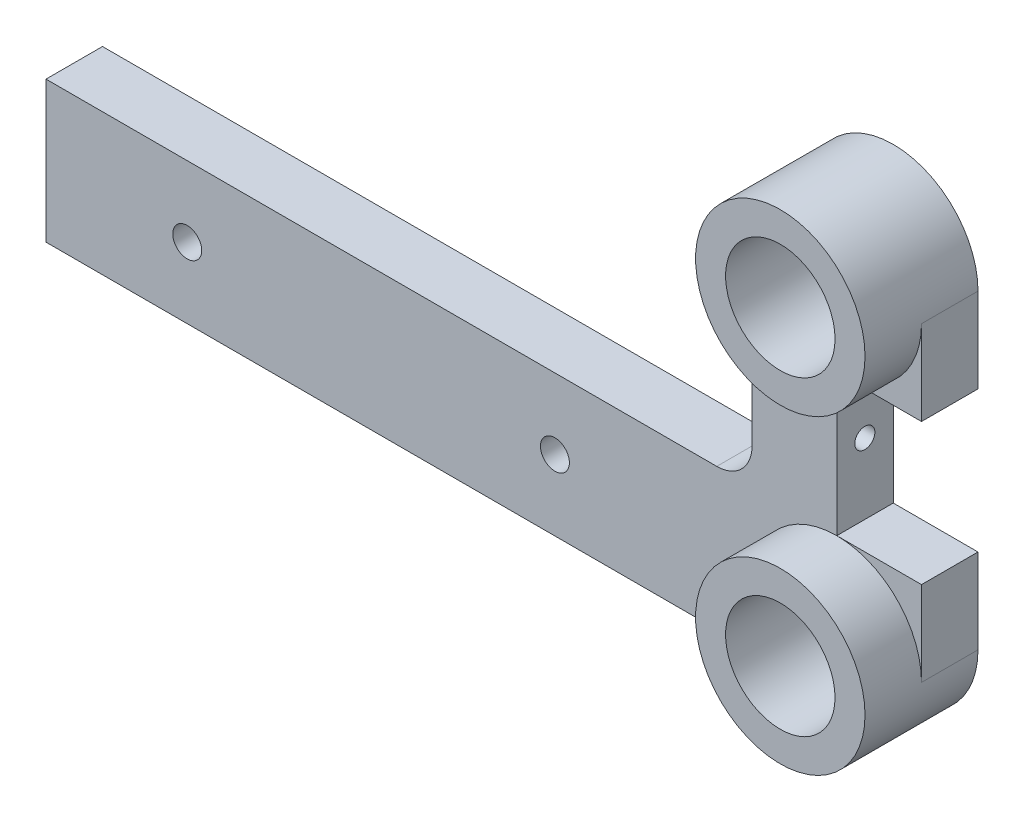
ISO-10303-21;
HEADER;
FILE_DESCRIPTION(('STEP AP214'),'2;1');
FILE_NAME('part.step','',(''),(''),'','','');
FILE_SCHEMA(('AUTOMOTIVE_DESIGN { 1 0 10303 214 1 1 1 1 }'));
ENDSEC;
DATA;
#1=APPLICATION_CONTEXT('core data for automotive mechanical design processes');
#2=APPLICATION_PROTOCOL_DEFINITION('international standard','automotive_design',2000,#1);
#3=PRODUCT_CONTEXT('',#1,'mechanical');
#4=PRODUCT('Part','Part','',(#3));
#5=PRODUCT_RELATED_PRODUCT_CATEGORY('part','',(#4));
#6=PRODUCT_DEFINITION_FORMATION('','',#4);
#7=PRODUCT_DEFINITION_CONTEXT('part definition',#1,'design');
#8=PRODUCT_DEFINITION('design','',#6,#7);
#9=PRODUCT_DEFINITION_SHAPE('','',#8);
#10=(LENGTH_UNIT() NAMED_UNIT(*) SI_UNIT(.MILLI.,.METRE.));
#11=(NAMED_UNIT(*) PLANE_ANGLE_UNIT() SI_UNIT($,.RADIAN.));
#12=(NAMED_UNIT(*) SI_UNIT($,.STERADIAN.) SOLID_ANGLE_UNIT());
#13=UNCERTAINTY_MEASURE_WITH_UNIT(LENGTH_MEASURE(1.E-05),#10,'distance_accuracy_value','');
#14=(GEOMETRIC_REPRESENTATION_CONTEXT(3) GLOBAL_UNCERTAINTY_ASSIGNED_CONTEXT((#13)) GLOBAL_UNIT_ASSIGNED_CONTEXT((#10,
#11,#12)) REPRESENTATION_CONTEXT('',''));
#15=CARTESIAN_POINT('',(0.,0.,0.));
#16=DIRECTION('',(0.,0.,1.));
#17=DIRECTION('',(1.,0.,0.));
#18=AXIS2_PLACEMENT_3D('',#15,#16,#17);
#19=CARTESIAN_POINT('',(0.,44.0000001788139,8.));
#20=DIRECTION('',(0.,0.,1.));
#21=DIRECTION('',(1.,0.,0.));
#22=AXIS2_PLACEMENT_3D('',#19,#20,#21);
#23=PLANE('',#22);
#24=CARTESIAN_POINT('',(-39.9238068438474,1.99999999999999,8.));
#25=DIRECTION('',(0.,0.,1.));
#26=DIRECTION('',(1.,0.,0.));
#27=AXIS2_PLACEMENT_3D('',#24,#25,#26);
#28=CIRCLE('',#27,2.04999999999998);
#29=CARTESIAN_POINT('',(-37.8738068438474,1.99999999999999,8.));
#30=VERTEX_POINT('',#29);
#31=EDGE_CURVE('E553',#30,#30,#28,.T.);
#32=ORIENTED_EDGE('',*,*,#31,.F.);
#33=EDGE_LOOP('',(#32));
#34=FACE_BOUND('',#33,.T.);
#35=CARTESIAN_POINT('',(-92.,1.99999999999999,8.));
#36=DIRECTION('',(0.,0.,1.));
#37=DIRECTION('',(1.,0.,0.));
#38=AXIS2_PLACEMENT_3D('',#35,#36,#37);
#39=CIRCLE('',#38,2.04999999999998);
#40=CARTESIAN_POINT('',(-89.95,1.99999999999999,8.));
#41=VERTEX_POINT('',#40);
#42=EDGE_CURVE('E559',#41,#41,#39,.T.);
#43=ORIENTED_EDGE('',*,*,#42,.F.);
#44=EDGE_LOOP('',(#43));
#45=FACE_BOUND('',#44,.T.);
#46=DIRECTION('',(-1.,0.,0.));
#47=VECTOR('',#46,1.);
#48=CARTESIAN_POINT('',(-7.,-8.00000000000001,8.));
#49=LINE('',#48,#47);
#50=CARTESIAN_POINT('',(-10.9544511501033,-8.00000000000001,8.));
#51=VERTEX_POINT('',#50);
#52=CARTESIAN_POINT('',(-112.,-8.00000000000001,8.));
#53=VERTEX_POINT('',#52);
#54=EDGE_CURVE('E189',#51,#53,#49,.T.);
#55=ORIENTED_EDGE('',*,*,#54,.F.);
#56=CARTESIAN_POINT('',(-10.9544511501033,-13.,8.));
#57=DIRECTION('',(0.,0.,1.));
#58=DIRECTION('',(1.,0.,0.));
#59=AXIS2_PLACEMENT_3D('',#56,#57,#58);
#60=CIRCLE('',#59,5.);
#61=CARTESIAN_POINT('',(-7.7325537530141,-9.1764705882353,8.));
#62=VERTEX_POINT('',#61);
#63=EDGE_CURVE('E244',#51,#62,#60,.F.);
#64=ORIENTED_EDGE('',*,*,#63,.T.);
#65=CARTESIAN_POINT('',(0.,0.,8.));
#66=DIRECTION('',(0.,0.,1.));
#67=DIRECTION('',(1.,0.,0.));
#68=AXIS2_PLACEMENT_3D('',#65,#66,#67);
#69=CIRCLE('',#68,12.);
#70=CARTESIAN_POINT('',(0.,12.,8.));
#71=VERTEX_POINT('',#70);
#72=EDGE_CURVE('E157',#71,#62,#69,.T.);
#73=ORIENTED_EDGE('',*,*,#72,.F.);
#74=DIRECTION('',(0.,1.,0.));
#75=VECTOR('',#74,1.);
#76=CARTESIAN_POINT('',(0.,12.,8.));
#77=LINE('',#76,#75);
#78=CARTESIAN_POINT('',(0.,32.,8.));
#79=VERTEX_POINT('',#78);
#80=EDGE_CURVE('E215',#71,#79,#77,.T.);
#81=ORIENTED_EDGE('',*,*,#80,.T.);
#82=CARTESIAN_POINT('',(0.,44.,8.));
#83=DIRECTION('',(0.,0.,1.));
#84=DIRECTION('',(1.,0.,0.));
#85=AXIS2_PLACEMENT_3D('',#82,#83,#84);
#86=CIRCLE('',#85,12.);
#87=CARTESIAN_POINT('',(-12.,44.0000001788139,8.));
#88=VERTEX_POINT('',#87);
#89=EDGE_CURVE('E168',#88,#79,#86,.T.);
#90=ORIENTED_EDGE('',*,*,#89,.F.);
#91=DIRECTION('',(0.,-1.,0.));
#92=VECTOR('',#91,1.);
#93=CARTESIAN_POINT('',(-12.,44.0000001788139,8.));
#94=LINE('',#93,#92);
#95=CARTESIAN_POINT('',(-12.,17.,8.));
#96=VERTEX_POINT('',#95);
#97=EDGE_CURVE('E144',#88,#96,#94,.T.);
#98=ORIENTED_EDGE('',*,*,#97,.T.);
#99=CARTESIAN_POINT('',(-17.,17.,8.));
#100=DIRECTION('',(0.,0.,1.));
#101=DIRECTION('',(1.,0.,0.));
#102=AXIS2_PLACEMENT_3D('',#99,#100,#101);
#103=CIRCLE('',#102,5.);
#104=CARTESIAN_POINT('',(-17.,12.,8.00000000000001));
#105=VERTEX_POINT('',#104);
#106=EDGE_CURVE('E11',#96,#105,#103,.F.);
#107=ORIENTED_EDGE('',*,*,#106,.T.);
#108=DIRECTION('',(-1.,0.,0.));
#109=VECTOR('',#108,1.);
#110=CARTESIAN_POINT('',(-7.,12.,8.00000000000001));
#111=LINE('',#110,#109);
#112=CARTESIAN_POINT('',(-112.,12.,8.00000000000001));
#113=VERTEX_POINT('',#112);
#114=EDGE_CURVE('E187',#105,#113,#111,.T.);
#115=ORIENTED_EDGE('',*,*,#114,.T.);
#116=DIRECTION('',(0.,1.,0.));
#117=VECTOR('',#116,1.);
#118=CARTESIAN_POINT('',(-112.,12.,8.00000000000001));
#119=LINE('',#118,#117);
#120=EDGE_CURVE('E178',#53,#113,#119,.T.);
#121=ORIENTED_EDGE('',*,*,#120,.F.);
#122=EDGE_LOOP('',(#55,#64,#73,#81,#90,#98,#107,#115,#121));
#123=FACE_BOUND('',#122,.T.);
#124=ADVANCED_FACE('F37',(#34,#45,#123),#23,.T.);
#125=DIRECTION('',(-1.,0.,0.));
#126=VECTOR('',#125,1.);
#127=CARTESIAN_POINT('',(12.,12.,8.));
#128=LINE('',#127,#126);
#129=CARTESIAN_POINT('',(12.,12.,8.));
#130=VERTEX_POINT('',#129);
#131=EDGE_CURVE('E143',#130,#71,#128,.T.);
#132=ORIENTED_EDGE('',*,*,#131,.T.);
#133=CARTESIAN_POINT('',(12.,0.,8.));
#134=VERTEX_POINT('',#133);
#135=EDGE_CURVE('E150',#134,#71,#69,.T.);
#136=ORIENTED_EDGE('',*,*,#135,.F.);
#137=DIRECTION('',(0.,1.,0.));
#138=VECTOR('',#137,1.);
#139=CARTESIAN_POINT('',(12.,0.,8.));
#140=LINE('',#139,#138);
#141=EDGE_CURVE('E132',#134,#130,#140,.T.);
#142=ORIENTED_EDGE('',*,*,#141,.T.);
#143=EDGE_LOOP('',(#132,#136,#142));
#144=FACE_BOUND('',#143,.T.);
#145=ADVANCED_FACE('F155',(#144),#23,.T.);
#146=CARTESIAN_POINT('',(0.,44.0000001788139,0.));
#147=DIRECTION('',(0.,0.,1.));
#148=DIRECTION('',(1.,0.,0.));
#149=AXIS2_PLACEMENT_3D('',#146,#147,#148);
#150=CYLINDRICAL_SURFACE('',#149,12.);
#151=DIRECTION('',(0.,0.,1.));
#152=VECTOR('',#151,1.);
#153=CARTESIAN_POINT('',(-12.,44.0000001788139,0.));
#154=LINE('',#153,#152);
#155=CARTESIAN_POINT('',(-12.,44.0000001788139,0.));
#156=VERTEX_POINT('',#155);
#157=EDGE_CURVE('E153',#156,#88,#154,.T.);
#158=ORIENTED_EDGE('',*,*,#157,.T.);
#159=ORIENTED_EDGE('',*,*,#89,.T.);
#160=CARTESIAN_POINT('',(12.,44.,8.));
#161=VERTEX_POINT('',#160);
#162=EDGE_CURVE('E172',#79,#161,#86,.T.);
#163=ORIENTED_EDGE('',*,*,#162,.T.);
#164=DIRECTION('',(0.,0.,1.));
#165=VECTOR('',#164,1.);
#166=CARTESIAN_POINT('',(12.,44.0000001788139,0.));
#167=LINE('',#166,#165);
#168=CARTESIAN_POINT('',(12.,44.0000001788139,0.));
#169=VERTEX_POINT('',#168);
#170=EDGE_CURVE('E222',#169,#161,#167,.T.);
#171=ORIENTED_EDGE('',*,*,#170,.F.);
#172=CARTESIAN_POINT('',(0.,44.0000001788139,0.));
#173=DIRECTION('',(0.,0.,1.));
#174=DIRECTION('',(1.,0.,0.));
#175=AXIS2_PLACEMENT_3D('',#172,#173,#174);
#176=CIRCLE('',#175,12.);
#177=EDGE_CURVE('E192',#169,#156,#176,.T.);
#178=ORIENTED_EDGE('',*,*,#177,.T.);
#179=EDGE_LOOP('',(#158,#159,#163,#171,#178));
#180=FACE_BOUND('',#179,.T.);
#181=CARTESIAN_POINT('',(0.,44.,16.));
#182=DIRECTION('',(0.,0.,1.));
#183=DIRECTION('',(1.,0.,0.));
#184=AXIS2_PLACEMENT_3D('',#181,#182,#183);
#185=CIRCLE('',#184,12.);
#186=CARTESIAN_POINT('',(12.,44.,16.));
#187=VERTEX_POINT('',#186);
#188=EDGE_CURVE('E160',#187,#187,#185,.T.);
#189=ORIENTED_EDGE('',*,*,#188,.F.);
#190=EDGE_LOOP('',(#189));
#191=FACE_BOUND('',#190,.T.);
#192=ADVANCED_FACE('F275',(#180,#191),#150,.T.);
#193=CARTESIAN_POINT('',(12.,32.,0.));
#194=DIRECTION('',(1.,0.,0.));
#195=DIRECTION('',(0.,1.,0.));
#196=AXIS2_PLACEMENT_3D('',#193,#194,#195);
#197=PLANE('',#196);
#198=DIRECTION('',(0.,1.,0.));
#199=VECTOR('',#198,1.);
#200=CARTESIAN_POINT('',(12.,32.,8.));
#201=LINE('',#200,#199);
#202=CARTESIAN_POINT('',(12.,32.,8.));
#203=VERTEX_POINT('',#202);
#204=EDGE_CURVE('E196',#203,#161,#201,.T.);
#205=ORIENTED_EDGE('',*,*,#204,.F.);
#206=DIRECTION('',(0.,0.,1.));
#207=VECTOR('',#206,1.);
#208=CARTESIAN_POINT('',(12.,32.,0.));
#209=LINE('',#208,#207);
#210=CARTESIAN_POINT('',(12.,32.,0.));
#211=VERTEX_POINT('',#210);
#212=EDGE_CURVE('E225',#211,#203,#209,.T.);
#213=ORIENTED_EDGE('',*,*,#212,.F.);
#214=DIRECTION('',(0.,1.,0.));
#215=VECTOR('',#214,1.);
#216=CARTESIAN_POINT('',(12.,32.,0.));
#217=LINE('',#216,#215);
#218=EDGE_CURVE('E210',#211,#169,#217,.T.);
#219=ORIENTED_EDGE('',*,*,#218,.T.);
#220=ORIENTED_EDGE('',*,*,#170,.T.);
#221=EDGE_LOOP('',(#205,#213,#219,#220));
#222=FACE_BOUND('',#221,.T.);
#223=ADVANCED_FACE('F280',(#222),#197,.T.);
#224=CARTESIAN_POINT('',(0.,32.,0.));
#225=DIRECTION('',(0.,-1.,0.));
#226=DIRECTION('',(0.,0.,-1.));
#227=AXIS2_PLACEMENT_3D('',#224,#225,#226);
#228=PLANE('',#227);
#229=DIRECTION('',(1.,0.,0.));
#230=VECTOR('',#229,1.);
#231=CARTESIAN_POINT('',(0.,32.,8.));
#232=LINE('',#231,#230);
#233=EDGE_CURVE('E218',#79,#203,#232,.T.);
#234=ORIENTED_EDGE('',*,*,#233,.F.);
#235=DIRECTION('',(0.,0.,1.));
#236=VECTOR('',#235,1.);
#237=CARTESIAN_POINT('',(0.,32.,0.));
#238=LINE('',#237,#236);
#239=CARTESIAN_POINT('',(0.,32.,0.));
#240=VERTEX_POINT('',#239);
#241=EDGE_CURVE('E227',#240,#79,#238,.T.);
#242=ORIENTED_EDGE('',*,*,#241,.F.);
#243=DIRECTION('',(1.,0.,0.));
#244=VECTOR('',#243,1.);
#245=CARTESIAN_POINT('',(0.,32.,0.));
#246=LINE('',#245,#244);
#247=EDGE_CURVE('E207',#240,#211,#246,.T.);
#248=ORIENTED_EDGE('',*,*,#247,.T.);
#249=ORIENTED_EDGE('',*,*,#212,.T.);
#250=EDGE_LOOP('',(#234,#242,#248,#249));
#251=FACE_BOUND('',#250,.T.);
#252=ADVANCED_FACE('F298',(#251),#228,.T.);
#253=CARTESIAN_POINT('',(0.,12.,0.));
#254=DIRECTION('',(1.,0.,0.));
#255=DIRECTION('',(0.,1.,0.));
#256=AXIS2_PLACEMENT_3D('',#253,#254,#255);
#257=PLANE('',#256);
#258=CARTESIAN_POINT('',(0.,22.,4.02999031281051));
#259=DIRECTION('',(1.,0.,0.));
#260=DIRECTION('',(0.,0.,-1.));
#261=AXIS2_PLACEMENT_3D('',#258,#259,#260);
#262=CIRCLE('',#261,1.42499999999999);
#263=CARTESIAN_POINT('',(0.,22.,2.60499031281052));
#264=VERTEX_POINT('',#263);
#265=EDGE_CURVE('E544',#264,#264,#262,.T.);
#266=ORIENTED_EDGE('',*,*,#265,.F.);
#267=EDGE_LOOP('',(#266));
#268=FACE_BOUND('',#267,.T.);
#269=ORIENTED_EDGE('',*,*,#80,.F.);
#270=DIRECTION('',(0.,0.,1.));
#271=VECTOR('',#270,1.);
#272=CARTESIAN_POINT('',(0.,12.,0.));
#273=LINE('',#272,#271);
#274=CARTESIAN_POINT('',(0.,12.,0.));
#275=VERTEX_POINT('',#274);
#276=EDGE_CURVE('E230',#275,#71,#273,.T.);
#277=ORIENTED_EDGE('',*,*,#276,.F.);
#278=DIRECTION('',(0.,1.,0.));
#279=VECTOR('',#278,1.);
#280=CARTESIAN_POINT('',(0.,12.,0.));
#281=LINE('',#280,#279);
#282=EDGE_CURVE('E204',#275,#240,#281,.T.);
#283=ORIENTED_EDGE('',*,*,#282,.T.);
#284=ORIENTED_EDGE('',*,*,#241,.T.);
#285=EDGE_LOOP('',(#269,#277,#283,#284));
#286=FACE_BOUND('',#285,.T.);
#287=ADVANCED_FACE('F287',(#268,#286),#257,.T.);
#288=CARTESIAN_POINT('',(12.,12.,0.));
#289=DIRECTION('',(0.,1.,0.));
#290=DIRECTION('',(0.,0.,1.));
#291=AXIS2_PLACEMENT_3D('',#288,#289,#290);
#292=PLANE('',#291);
#293=ORIENTED_EDGE('',*,*,#131,.F.);
#294=DIRECTION('',(0.,0.,1.));
#295=VECTOR('',#294,1.);
#296=CARTESIAN_POINT('',(12.,12.,0.));
#297=LINE('',#296,#295);
#298=CARTESIAN_POINT('',(12.,12.,0.));
#299=VERTEX_POINT('',#298);
#300=EDGE_CURVE('E138',#299,#130,#297,.T.);
#301=ORIENTED_EDGE('',*,*,#300,.F.);
#302=DIRECTION('',(-1.,0.,0.));
#303=VECTOR('',#302,1.);
#304=CARTESIAN_POINT('',(12.,12.,0.));
#305=LINE('',#304,#303);
#306=EDGE_CURVE('E201',#299,#275,#305,.T.);
#307=ORIENTED_EDGE('',*,*,#306,.T.);
#308=ORIENTED_EDGE('',*,*,#276,.T.);
#309=EDGE_LOOP('',(#293,#301,#307,#308));
#310=FACE_BOUND('',#309,.T.);
#311=ADVANCED_FACE('F290',(#310),#292,.T.);
#312=CARTESIAN_POINT('',(12.,0.,0.));
#313=DIRECTION('',(1.,0.,0.));
#314=DIRECTION('',(0.,0.,-1.));
#315=AXIS2_PLACEMENT_3D('',#312,#313,#314);
#316=PLANE('',#315);
#317=ORIENTED_EDGE('',*,*,#141,.F.);
#318=DIRECTION('',(0.,0.,1.));
#319=VECTOR('',#318,1.);
#320=CARTESIAN_POINT('',(12.,0.,0.));
#321=LINE('',#320,#319);
#322=CARTESIAN_POINT('',(12.,0.,0.));
#323=VERTEX_POINT('',#322);
#324=EDGE_CURVE('E136',#323,#134,#321,.T.);
#325=ORIENTED_EDGE('',*,*,#324,.F.);
#326=DIRECTION('',(0.,1.,0.));
#327=VECTOR('',#326,1.);
#328=CARTESIAN_POINT('',(12.,0.,0.));
#329=LINE('',#328,#327);
#330=EDGE_CURVE('E199',#323,#299,#329,.T.);
#331=ORIENTED_EDGE('',*,*,#330,.T.);
#332=ORIENTED_EDGE('',*,*,#300,.T.);
#333=EDGE_LOOP('',(#317,#325,#331,#332));
#334=FACE_BOUND('',#333,.T.);
#335=ADVANCED_FACE('F134',(#334),#316,.T.);
#336=CARTESIAN_POINT('',(0.,0.,0.));
#337=DIRECTION('',(0.,0.,1.));
#338=DIRECTION('',(1.,0.,0.));
#339=AXIS2_PLACEMENT_3D('',#336,#337,#338);
#340=CYLINDRICAL_SURFACE('',#339,12.);
#341=ORIENTED_EDGE('',*,*,#72,.T.);
#342=DIRECTION('',(0.,0.,1.));
#343=VECTOR('',#342,1.);
#344=CARTESIAN_POINT('',(-7.73255375301411,-9.1764705882353,0.));
#345=LINE('',#344,#343);
#346=CARTESIAN_POINT('',(-7.7325537530141,-9.1764705882353,0.));
#347=VERTEX_POINT('',#346);
#348=EDGE_CURVE('E238',#62,#347,#345,.F.);
#349=ORIENTED_EDGE('',*,*,#348,.T.);
#350=CARTESIAN_POINT('',(0.,0.,0.));
#351=DIRECTION('',(0.,0.,1.));
#352=DIRECTION('',(1.,0.,0.));
#353=AXIS2_PLACEMENT_3D('',#350,#351,#352);
#354=CIRCLE('',#353,12.);
#355=EDGE_CURVE('E152',#347,#323,#354,.T.);
#356=ORIENTED_EDGE('',*,*,#355,.T.);
#357=ORIENTED_EDGE('',*,*,#324,.T.);
#358=ORIENTED_EDGE('',*,*,#135,.T.);
#359=EDGE_LOOP('',(#341,#349,#356,#357,#358));
#360=FACE_BOUND('',#359,.T.);
#361=CARTESIAN_POINT('',(0.,0.,16.));
#362=DIRECTION('',(0.,0.,1.));
#363=DIRECTION('',(1.,0.,0.));
#364=AXIS2_PLACEMENT_3D('',#361,#362,#363);
#365=CIRCLE('',#364,12.);
#366=CARTESIAN_POINT('',(12.,0.,16.));
#367=VERTEX_POINT('',#366);
#368=EDGE_CURVE('E156',#367,#367,#365,.T.);
#369=ORIENTED_EDGE('',*,*,#368,.F.);
#370=EDGE_LOOP('',(#369));
#371=FACE_BOUND('',#370,.T.);
#372=ADVANCED_FACE('F148',(#360,#371),#340,.T.);
#373=CARTESIAN_POINT('',(-12.,44.0000001788139,0.));
#374=DIRECTION('',(-1.,0.,0.));
#375=DIRECTION('',(0.,0.,1.));
#376=AXIS2_PLACEMENT_3D('',#373,#374,#375);
#377=PLANE('',#376);
#378=DIRECTION('',(0.,-1.,0.));
#379=VECTOR('',#378,1.);
#380=CARTESIAN_POINT('',(-12.,44.0000001788139,0.));
#381=LINE('',#380,#379);
#382=CARTESIAN_POINT('',(-12.,17.,0.));
#383=VERTEX_POINT('',#382);
#384=EDGE_CURVE('E195',#156,#383,#381,.T.);
#385=ORIENTED_EDGE('',*,*,#384,.T.);
#386=DIRECTION('',(0.,0.,-1.));
#387=VECTOR('',#386,1.);
#388=CARTESIAN_POINT('',(-12.,17.,8.00000000000001));
#389=LINE('',#388,#387);
#390=EDGE_CURVE('E58',#383,#96,#389,.F.);
#391=ORIENTED_EDGE('',*,*,#390,.T.);
#392=ORIENTED_EDGE('',*,*,#97,.F.);
#393=ORIENTED_EDGE('',*,*,#157,.F.);
#394=EDGE_LOOP('',(#385,#391,#392,#393));
#395=FACE_BOUND('',#394,.T.);
#396=ADVANCED_FACE('F271',(#395),#377,.T.);
#397=CARTESIAN_POINT('',(0.,44.0000001788139,0.));
#398=DIRECTION('',(0.,0.,1.));
#399=DIRECTION('',(1.,0.,0.));
#400=AXIS2_PLACEMENT_3D('',#397,#398,#399);
#401=PLANE('',#400);
#402=CARTESIAN_POINT('',(0.,44.,0.));
#403=DIRECTION('',(0.,0.,1.));
#404=DIRECTION('',(1.,0.,0.));
#405=AXIS2_PLACEMENT_3D('',#402,#403,#404);
#406=CIRCLE('',#405,7.75);
#407=CARTESIAN_POINT('',(7.75,44.,0.));
#408=VERTEX_POINT('',#407);
#409=EDGE_CURVE('E537',#408,#408,#406,.T.);
#410=ORIENTED_EDGE('',*,*,#409,.T.);
#411=EDGE_LOOP('',(#410));
#412=FACE_BOUND('',#411,.T.);
#413=CARTESIAN_POINT('',(0.,0.,0.));
#414=DIRECTION('',(0.,0.,1.));
#415=DIRECTION('',(1.,0.,0.));
#416=AXIS2_PLACEMENT_3D('',#413,#414,#415);
#417=CIRCLE('',#416,7.75);
#418=CARTESIAN_POINT('',(7.75,0.,0.));
#419=VERTEX_POINT('',#418);
#420=EDGE_CURVE('E550',#419,#419,#417,.T.);
#421=ORIENTED_EDGE('',*,*,#420,.T.);
#422=EDGE_LOOP('',(#421));
#423=FACE_BOUND('',#422,.T.);
#424=CARTESIAN_POINT('',(-39.9238068438474,1.99999999999999,0.));
#425=DIRECTION('',(0.,0.,1.));
#426=DIRECTION('',(1.,0.,0.));
#427=AXIS2_PLACEMENT_3D('',#424,#425,#426);
#428=CIRCLE('',#427,2.04999999999998);
#429=CARTESIAN_POINT('',(-37.8738068438474,1.99999999999999,0.));
#430=VERTEX_POINT('',#429);
#431=EDGE_CURVE('E556',#430,#430,#428,.T.);
#432=ORIENTED_EDGE('',*,*,#431,.T.);
#433=EDGE_LOOP('',(#432));
#434=FACE_BOUND('',#433,.T.);
#435=CARTESIAN_POINT('',(-92.,1.99999999999999,0.));
#436=DIRECTION('',(0.,0.,1.));
#437=DIRECTION('',(1.,0.,0.));
#438=AXIS2_PLACEMENT_3D('',#435,#436,#437);
#439=CIRCLE('',#438,2.04999999999998);
#440=CARTESIAN_POINT('',(-89.95,1.99999999999999,0.));
#441=VERTEX_POINT('',#440);
#442=EDGE_CURVE('E162',#441,#441,#439,.T.);
#443=ORIENTED_EDGE('',*,*,#442,.T.);
#444=EDGE_LOOP('',(#443));
#445=FACE_BOUND('',#444,.T.);
#446=ORIENTED_EDGE('',*,*,#355,.F.);
#447=CARTESIAN_POINT('',(-10.9544511501033,-13.,0.));
#448=DIRECTION('',(0.,0.,1.));
#449=DIRECTION('',(1.,0.,0.));
#450=AXIS2_PLACEMENT_3D('',#447,#448,#449);
#451=CIRCLE('',#450,5.);
#452=CARTESIAN_POINT('',(-10.9544511501033,-8.00000000000001,0.));
#453=VERTEX_POINT('',#452);
#454=EDGE_CURVE('E247',#347,#453,#451,.T.);
#455=ORIENTED_EDGE('',*,*,#454,.T.);
#456=DIRECTION('',(-1.,0.,0.));
#457=VECTOR('',#456,1.);
#458=CARTESIAN_POINT('',(-7.,-8.00000000000001,0.));
#459=LINE('',#458,#457);
#460=CARTESIAN_POINT('',(-112.,-8.00000000000001,0.));
#461=VERTEX_POINT('',#460);
#462=EDGE_CURVE('E184',#453,#461,#459,.T.);
#463=ORIENTED_EDGE('',*,*,#462,.T.);
#464=DIRECTION('',(0.,-1.,0.));
#465=VECTOR('',#464,1.);
#466=CARTESIAN_POINT('',(-112.,12.,0.));
#467=LINE('',#466,#465);
#468=CARTESIAN_POINT('',(-112.,12.,0.));
#469=VERTEX_POINT('',#468);
#470=EDGE_CURVE('E167',#469,#461,#467,.T.);
#471=ORIENTED_EDGE('',*,*,#470,.F.);
#472=DIRECTION('',(-1.,0.,0.));
#473=VECTOR('',#472,1.);
#474=CARTESIAN_POINT('',(-7.,12.,0.));
#475=LINE('',#474,#473);
#476=CARTESIAN_POINT('',(-17.,12.,0.));
#477=VERTEX_POINT('',#476);
#478=EDGE_CURVE('E185',#477,#469,#475,.T.);
#479=ORIENTED_EDGE('',*,*,#478,.F.);
#480=CARTESIAN_POINT('',(-17.,17.,0.));
#481=DIRECTION('',(0.,0.,1.));
#482=DIRECTION('',(1.,0.,0.));
#483=AXIS2_PLACEMENT_3D('',#480,#481,#482);
#484=CIRCLE('',#483,5.);
#485=EDGE_CURVE('E45',#477,#383,#484,.T.);
#486=ORIENTED_EDGE('',*,*,#485,.T.);
#487=ORIENTED_EDGE('',*,*,#384,.F.);
#488=ORIENTED_EDGE('',*,*,#177,.F.);
#489=ORIENTED_EDGE('',*,*,#218,.F.);
#490=ORIENTED_EDGE('',*,*,#247,.F.);
#491=ORIENTED_EDGE('',*,*,#282,.F.);
#492=ORIENTED_EDGE('',*,*,#306,.F.);
#493=ORIENTED_EDGE('',*,*,#330,.F.);
#494=EDGE_LOOP('',(#446,#455,#463,#471,#479,#486,#487,#488,#489,#490,#491,#492,#493));
#495=FACE_BOUND('',#494,.T.);
#496=ADVANCED_FACE('F250',(#412,#423,#434,#445,#495),#401,.F.);
#497=ORIENTED_EDGE('',*,*,#162,.F.);
#498=ORIENTED_EDGE('',*,*,#233,.T.);
#499=ORIENTED_EDGE('',*,*,#204,.T.);
#500=EDGE_LOOP('',(#497,#498,#499));
#501=FACE_BOUND('',#500,.T.);
#502=ADVANCED_FACE('F304',(#501),#23,.T.);
#503=CARTESIAN_POINT('',(-7.,12.,0.));
#504=DIRECTION('',(0.,1.,0.));
#505=DIRECTION('',(0.,0.,1.));
#506=AXIS2_PLACEMENT_3D('',#503,#504,#505);
#507=PLANE('',#506);
#508=ORIENTED_EDGE('',*,*,#114,.F.);
#509=DIRECTION('',(0.,0.,-1.));
#510=VECTOR('',#509,1.);
#511=CARTESIAN_POINT('',(-17.,12.,0.));
#512=LINE('',#511,#510);
#513=EDGE_CURVE('E240',#105,#477,#512,.T.);
#514=ORIENTED_EDGE('',*,*,#513,.T.);
#515=ORIENTED_EDGE('',*,*,#478,.T.);
#516=DIRECTION('',(0.,0.,-1.));
#517=VECTOR('',#516,1.);
#518=CARTESIAN_POINT('',(-112.,12.,0.));
#519=LINE('',#518,#517);
#520=EDGE_CURVE('E181',#113,#469,#519,.T.);
#521=ORIENTED_EDGE('',*,*,#520,.F.);
#522=EDGE_LOOP('',(#508,#514,#515,#521));
#523=FACE_BOUND('',#522,.T.);
#524=ADVANCED_FACE('F267',(#523),#507,.T.);
#525=CARTESIAN_POINT('',(-7.,-8.00000000000001,0.));
#526=DIRECTION('',(0.,-1.,0.));
#527=DIRECTION('',(0.,0.,-1.));
#528=AXIS2_PLACEMENT_3D('',#525,#526,#527);
#529=PLANE('',#528);
#530=ORIENTED_EDGE('',*,*,#462,.F.);
#531=DIRECTION('',(0.,0.,-1.));
#532=VECTOR('',#531,1.);
#533=CARTESIAN_POINT('',(-10.9544511501033,-8.00000000000001,8.));
#534=LINE('',#533,#532);
#535=EDGE_CURVE('E171',#453,#51,#534,.F.);
#536=ORIENTED_EDGE('',*,*,#535,.T.);
#537=ORIENTED_EDGE('',*,*,#54,.T.);
#538=DIRECTION('',(0.,0.,1.));
#539=VECTOR('',#538,1.);
#540=CARTESIAN_POINT('',(-112.,-8.00000000000001,0.));
#541=LINE('',#540,#539);
#542=EDGE_CURVE('E175',#461,#53,#541,.T.);
#543=ORIENTED_EDGE('',*,*,#542,.F.);
#544=EDGE_LOOP('',(#530,#536,#537,#543));
#545=FACE_BOUND('',#544,.T.);
#546=ADVANCED_FACE('F257',(#545),#529,.T.);
#547=CARTESIAN_POINT('',(-112.,0.,0.));
#548=DIRECTION('',(-1.,0.,0.));
#549=DIRECTION('',(0.,0.,1.));
#550=AXIS2_PLACEMENT_3D('',#547,#548,#549);
#551=PLANE('',#550);
#552=ORIENTED_EDGE('',*,*,#470,.T.);
#553=ORIENTED_EDGE('',*,*,#542,.T.);
#554=ORIENTED_EDGE('',*,*,#120,.T.);
#555=ORIENTED_EDGE('',*,*,#520,.T.);
#556=EDGE_LOOP('',(#552,#553,#554,#555));
#557=FACE_BOUND('',#556,.T.);
#558=ADVANCED_FACE('F263',(#557),#551,.T.);
#559=CARTESIAN_POINT('',(0.,44.,16.));
#560=DIRECTION('',(0.,0.,1.));
#561=DIRECTION('',(1.,0.,0.));
#562=AXIS2_PLACEMENT_3D('',#559,#560,#561);
#563=PLANE('',#562);
#564=CARTESIAN_POINT('',(0.,44.,16.));
#565=DIRECTION('',(0.,0.,1.));
#566=DIRECTION('',(1.,0.,0.));
#567=AXIS2_PLACEMENT_3D('',#564,#565,#566);
#568=CIRCLE('',#567,7.74999999999999);
#569=CARTESIAN_POINT('',(7.74999999999999,44.,16.));
#570=VERTEX_POINT('',#569);
#571=EDGE_CURVE('E534',#570,#570,#568,.T.);
#572=ORIENTED_EDGE('',*,*,#571,.F.);
#573=EDGE_LOOP('',(#572));
#574=FACE_BOUND('',#573,.T.);
#575=ORIENTED_EDGE('',*,*,#188,.T.);
#576=EDGE_LOOP('',(#575));
#577=FACE_BOUND('',#576,.T.);
#578=ADVANCED_FACE('F369',(#574,#577),#563,.T.);
#579=CARTESIAN_POINT('',(0.,0.,16.));
#580=DIRECTION('',(0.,0.,1.));
#581=DIRECTION('',(1.,0.,0.));
#582=AXIS2_PLACEMENT_3D('',#579,#580,#581);
#583=PLANE('',#582);
#584=CARTESIAN_POINT('',(0.,0.,16.));
#585=DIRECTION('',(0.,0.,1.));
#586=DIRECTION('',(1.,0.,0.));
#587=AXIS2_PLACEMENT_3D('',#584,#585,#586);
#588=CIRCLE('',#587,7.74999999999999);
#589=CARTESIAN_POINT('',(7.74999999999999,0.,16.));
#590=VERTEX_POINT('',#589);
#591=EDGE_CURVE('E541',#590,#590,#588,.T.);
#592=ORIENTED_EDGE('',*,*,#591,.F.);
#593=EDGE_LOOP('',(#592));
#594=FACE_BOUND('',#593,.T.);
#595=ORIENTED_EDGE('',*,*,#368,.T.);
#596=EDGE_LOOP('',(#595));
#597=FACE_BOUND('',#596,.T.);
#598=ADVANCED_FACE('F365',(#594,#597),#583,.T.);
#599=CARTESIAN_POINT('',(-92.,1.99999999999999,8.));
#600=DIRECTION('',(0.,0.,1.));
#601=DIRECTION('',(1.,0.,0.));
#602=AXIS2_PLACEMENT_3D('',#599,#600,#601);
#603=CYLINDRICAL_SURFACE('',#602,2.04999999999998);
#604=ORIENTED_EDGE('',*,*,#442,.F.);
#605=EDGE_LOOP('',(#604));
#606=FACE_BOUND('',#605,.T.);
#607=ORIENTED_EDGE('',*,*,#42,.T.);
#608=EDGE_LOOP('',(#607));
#609=FACE_BOUND('',#608,.T.);
#610=ADVANCED_FACE('F361',(#606,#609),#603,.F.);
#611=CARTESIAN_POINT('',(-39.9238068438474,1.99999999999999,8.));
#612=DIRECTION('',(0.,0.,1.));
#613=DIRECTION('',(1.,0.,0.));
#614=AXIS2_PLACEMENT_3D('',#611,#612,#613);
#615=CYLINDRICAL_SURFACE('',#614,2.04999999999998);
#616=ORIENTED_EDGE('',*,*,#431,.F.);
#617=EDGE_LOOP('',(#616));
#618=FACE_BOUND('',#617,.T.);
#619=ORIENTED_EDGE('',*,*,#31,.T.);
#620=EDGE_LOOP('',(#619));
#621=FACE_BOUND('',#620,.T.);
#622=ADVANCED_FACE('F357',(#618,#621),#615,.F.);
#623=CARTESIAN_POINT('',(0.,0.,16.));
#624=DIRECTION('',(0.,0.,1.));
#625=DIRECTION('',(1.,0.,0.));
#626=AXIS2_PLACEMENT_3D('',#623,#624,#625);
#627=CYLINDRICAL_SURFACE('',#626,7.74999999999999);
#628=ORIENTED_EDGE('',*,*,#420,.F.);
#629=EDGE_LOOP('',(#628));
#630=FACE_BOUND('',#629,.T.);
#631=ORIENTED_EDGE('',*,*,#591,.T.);
#632=EDGE_LOOP('',(#631));
#633=FACE_BOUND('',#632,.T.);
#634=ADVANCED_FACE('F353',(#630,#633),#627,.F.);
#635=CARTESIAN_POINT('',(0.,44.,16.));
#636=DIRECTION('',(0.,0.,1.));
#637=DIRECTION('',(1.,0.,0.));
#638=AXIS2_PLACEMENT_3D('',#635,#636,#637);
#639=CYLINDRICAL_SURFACE('',#638,7.74999999999999);
#640=ORIENTED_EDGE('',*,*,#409,.F.);
#641=EDGE_LOOP('',(#640));
#642=FACE_BOUND('',#641,.T.);
#643=ORIENTED_EDGE('',*,*,#571,.T.);
#644=EDGE_LOOP('',(#643));
#645=FACE_BOUND('',#644,.T.);
#646=ADVANCED_FACE('F345',(#642,#645),#639,.F.);
#647=CARTESIAN_POINT('',(-9.99999999999999,22.,4.02999031281051));
#648=DIRECTION('',(-1.,0.,0.));
#649=DIRECTION('',(0.,0.,1.));
#650=AXIS2_PLACEMENT_3D('',#647,#648,#649);
#651=PLANE('',#650);
#652=CARTESIAN_POINT('',(-9.99999999999999,22.,4.02999031281051));
#653=DIRECTION('',(1.,0.,0.));
#654=DIRECTION('',(0.,0.,-1.));
#655=AXIS2_PLACEMENT_3D('',#652,#653,#654);
#656=CIRCLE('',#655,1.42499999999999);
#657=CARTESIAN_POINT('',(-9.99999999999999,22.,2.60499031281052));
#658=VERTEX_POINT('',#657);
#659=EDGE_CURVE('E538',#658,#658,#656,.T.);
#660=ORIENTED_EDGE('',*,*,#659,.T.);
#661=EDGE_LOOP('',(#660));
#662=FACE_BOUND('',#661,.T.);
#663=ADVANCED_FACE('F339',(#662),#651,.F.);
#664=CARTESIAN_POINT('',(0.,22.,4.02999031281051));
#665=DIRECTION('',(1.,0.,0.));
#666=DIRECTION('',(0.,0.,-1.));
#667=AXIS2_PLACEMENT_3D('',#664,#665,#666);
#668=CYLINDRICAL_SURFACE('',#667,1.42499999999999);
#669=ORIENTED_EDGE('',*,*,#659,.F.);
#670=EDGE_LOOP('',(#669));
#671=FACE_BOUND('',#670,.T.);
#672=ORIENTED_EDGE('',*,*,#265,.T.);
#673=EDGE_LOOP('',(#672));
#674=FACE_BOUND('',#673,.T.);
#675=ADVANCED_FACE('F334',(#671,#674),#668,.F.);
#676=CARTESIAN_POINT('',(-10.9544511501033,-13.,0.));
#677=DIRECTION('',(0.,0.,1.));
#678=DIRECTION('',(1.,0.,0.));
#679=AXIS2_PLACEMENT_3D('',#676,#677,#678);
#680=CYLINDRICAL_SURFACE('',#679,5.);
#681=ORIENTED_EDGE('',*,*,#454,.F.);
#682=ORIENTED_EDGE('',*,*,#348,.F.);
#683=ORIENTED_EDGE('',*,*,#63,.F.);
#684=ORIENTED_EDGE('',*,*,#535,.F.);
#685=EDGE_LOOP('',(#681,#682,#683,#684));
#686=FACE_BOUND('',#685,.T.);
#687=ADVANCED_FACE('F259',(#686),#680,.F.);
#688=CARTESIAN_POINT('',(-17.,17.,0.));
#689=DIRECTION('',(0.,0.,1.));
#690=DIRECTION('',(1.,0.,0.));
#691=AXIS2_PLACEMENT_3D('',#688,#689,#690);
#692=CYLINDRICAL_SURFACE('',#691,5.);
#693=ORIENTED_EDGE('',*,*,#106,.F.);
#694=ORIENTED_EDGE('',*,*,#390,.F.);
#695=ORIENTED_EDGE('',*,*,#485,.F.);
#696=ORIENTED_EDGE('',*,*,#513,.F.);
#697=EDGE_LOOP('',(#693,#694,#695,#696));
#698=FACE_BOUND('',#697,.T.);
#699=ADVANCED_FACE('F39',(#698),#692,.F.);
#700=CLOSED_SHELL('',(#124,#145,#192,#223,#252,#287,#311,#335,#372,#396,#496,#502,#524,#546,
#558,#578,#598,#610,#622,#634,#646,#663,#675,#687,#699));
#701=MANIFOLD_SOLID_BREP('B2',#700);
#702=ADVANCED_BREP_SHAPE_REPRESENTATION('',(#18,#701),#14);
#703=SHAPE_DEFINITION_REPRESENTATION(#9,#702);
ENDSEC;
END-ISO-10303-21;
